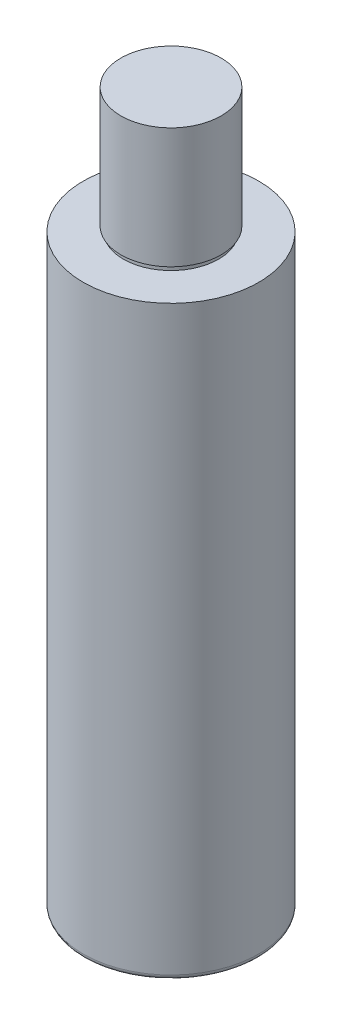
ISO-10303-21;
HEADER;
FILE_DESCRIPTION(('STEP AP214'),'2;1');
FILE_NAME('part.step','',(''),(''),'','','');
FILE_SCHEMA(('AUTOMOTIVE_DESIGN { 1 0 10303 214 1 1 1 1 }'));
ENDSEC;
DATA;
#1=APPLICATION_CONTEXT('core data for automotive mechanical design processes');
#2=APPLICATION_PROTOCOL_DEFINITION('international standard','automotive_design',2000,#1);
#3=PRODUCT_CONTEXT('',#1,'mechanical');
#4=PRODUCT('Part','Part','',(#3));
#5=PRODUCT_RELATED_PRODUCT_CATEGORY('part','',(#4));
#6=PRODUCT_DEFINITION_FORMATION('','',#4);
#7=PRODUCT_DEFINITION_CONTEXT('part definition',#1,'design');
#8=PRODUCT_DEFINITION('design','',#6,#7);
#9=PRODUCT_DEFINITION_SHAPE('','',#8);
#10=(LENGTH_UNIT() NAMED_UNIT(*) SI_UNIT(.MILLI.,.METRE.));
#11=(NAMED_UNIT(*) PLANE_ANGLE_UNIT() SI_UNIT($,.RADIAN.));
#12=(NAMED_UNIT(*) SI_UNIT($,.STERADIAN.) SOLID_ANGLE_UNIT());
#13=UNCERTAINTY_MEASURE_WITH_UNIT(LENGTH_MEASURE(1.E-05),#10,'distance_accuracy_value','');
#14=(GEOMETRIC_REPRESENTATION_CONTEXT(3) GLOBAL_UNCERTAINTY_ASSIGNED_CONTEXT((#13)) GLOBAL_UNIT_ASSIGNED_CONTEXT((#10,
#11,#12)) REPRESENTATION_CONTEXT('',''));
#15=CARTESIAN_POINT('',(0.,0.,0.));
#16=DIRECTION('',(0.,0.,1.));
#17=DIRECTION('',(1.,0.,0.));
#18=AXIS2_PLACEMENT_3D('',#15,#16,#17);
#19=CARTESIAN_POINT('',(0.,142.,0.));
#20=DIRECTION('',(0.,-1.,0.));
#21=DIRECTION('',(0.,0.,-1.));
#22=AXIS2_PLACEMENT_3D('',#19,#20,#21);
#23=CYLINDRICAL_SURFACE('',#22,17.5);
#24=CARTESIAN_POINT('',(0.,1.,0.));
#25=DIRECTION('',(0.,1.,0.));
#26=DIRECTION('',(0.,0.,1.));
#27=AXIS2_PLACEMENT_3D('',#24,#25,#26);
#28=CIRCLE('',#27,17.5);
#29=CARTESIAN_POINT('',(0.,1.,17.5));
#30=VERTEX_POINT('',#29);
#31=EDGE_CURVE('E42',#30,#30,#28,.T.);
#32=ORIENTED_EDGE('',*,*,#31,.T.);
#33=EDGE_LOOP('',(#32));
#34=FACE_BOUND('',#33,.T.);
#35=CARTESIAN_POINT('',(0.,117.,0.));
#36=DIRECTION('',(0.,1.,0.));
#37=DIRECTION('',(0.,0.,1.));
#38=AXIS2_PLACEMENT_3D('',#35,#36,#37);
#39=CIRCLE('',#38,17.5);
#40=CARTESIAN_POINT('',(0.,117.,17.5));
#41=VERTEX_POINT('',#40);
#42=EDGE_CURVE('E46',#41,#41,#39,.T.);
#43=ORIENTED_EDGE('',*,*,#42,.F.);
#44=EDGE_LOOP('',(#43));
#45=FACE_BOUND('',#44,.T.);
#46=ADVANCED_FACE('F35',(#34,#45),#23,.T.);
#47=CARTESIAN_POINT('',(0.,0.,0.));
#48=DIRECTION('',(0.,1.,0.));
#49=DIRECTION('',(0.,0.,1.));
#50=AXIS2_PLACEMENT_3D('',#47,#48,#49);
#51=PLANE('',#50);
#52=CARTESIAN_POINT('',(0.,0.,0.));
#53=DIRECTION('',(0.,1.,0.));
#54=DIRECTION('',(0.,0.,1.));
#55=AXIS2_PLACEMENT_3D('',#52,#53,#54);
#56=CIRCLE('',#55,16.5);
#57=CARTESIAN_POINT('',(0.,0.,16.5));
#58=VERTEX_POINT('',#57);
#59=EDGE_CURVE('E11',#58,#58,#56,.F.);
#60=ORIENTED_EDGE('',*,*,#59,.T.);
#61=EDGE_LOOP('',(#60));
#62=FACE_BOUND('',#61,.T.);
#63=ADVANCED_FACE('F76',(#62),#51,.F.);
#64=CARTESIAN_POINT('',(0.,117.,0.));
#65=DIRECTION('',(0.,1.,0.));
#66=DIRECTION('',(0.,0.,1.));
#67=AXIS2_PLACEMENT_3D('',#64,#65,#66);
#68=PLANE('',#67);
#69=ORIENTED_EDGE('',*,*,#42,.T.);
#70=EDGE_LOOP('',(#69));
#71=FACE_BOUND('',#70,.T.);
#72=CARTESIAN_POINT('',(0.,117.,0.));
#73=DIRECTION('',(0.,1.,0.));
#74=DIRECTION('',(0.,0.,1.));
#75=AXIS2_PLACEMENT_3D('',#72,#73,#74);
#76=CIRCLE('',#75,9.5);
#77=CARTESIAN_POINT('',(0.,117.,9.5));
#78=VERTEX_POINT('',#77);
#79=EDGE_CURVE('E59',#78,#78,#76,.T.);
#80=ORIENTED_EDGE('',*,*,#79,.F.);
#81=EDGE_LOOP('',(#80));
#82=FACE_BOUND('',#81,.T.);
#83=ADVANCED_FACE('F74',(#71,#82),#68,.T.);
#84=CARTESIAN_POINT('',(0.,118.,0.));
#85=DIRECTION('',(0.,1.,0.));
#86=DIRECTION('',(0.,0.,1.));
#87=AXIS2_PLACEMENT_3D('',#84,#85,#86);
#88=PLANE('',#87);
#89=CARTESIAN_POINT('',(0.,118.,0.));
#90=DIRECTION('',(0.,1.,0.));
#91=DIRECTION('',(0.,0.,1.));
#92=AXIS2_PLACEMENT_3D('',#89,#90,#91);
#93=CIRCLE('',#92,10.);
#94=CARTESIAN_POINT('',(0.,118.,10.));
#95=VERTEX_POINT('',#94);
#96=EDGE_CURVE('E53',#95,#95,#93,.F.);
#97=ORIENTED_EDGE('',*,*,#96,.T.);
#98=EDGE_LOOP('',(#97));
#99=FACE_BOUND('',#98,.T.);
#100=CARTESIAN_POINT('',(0.,118.,0.));
#101=DIRECTION('',(0.,1.,0.));
#102=DIRECTION('',(0.,0.,1.));
#103=AXIS2_PLACEMENT_3D('',#100,#101,#102);
#104=CIRCLE('',#103,9.5);
#105=CARTESIAN_POINT('',(0.,118.,9.5));
#106=VERTEX_POINT('',#105);
#107=EDGE_CURVE('E55',#106,#106,#104,.T.);
#108=ORIENTED_EDGE('',*,*,#107,.T.);
#109=EDGE_LOOP('',(#108));
#110=FACE_BOUND('',#109,.T.);
#111=ADVANCED_FACE('F65',(#99,#110),#88,.F.);
#112=CARTESIAN_POINT('',(0.,118.,0.));
#113=DIRECTION('',(0.,-1.,0.));
#114=DIRECTION('',(0.,0.,-1.));
#115=AXIS2_PLACEMENT_3D('',#112,#113,#114);
#116=CYLINDRICAL_SURFACE('',#115,9.5);
#117=ORIENTED_EDGE('',*,*,#107,.F.);
#118=EDGE_LOOP('',(#117));
#119=FACE_BOUND('',#118,.T.);
#120=ORIENTED_EDGE('',*,*,#79,.T.);
#121=EDGE_LOOP('',(#120));
#122=FACE_BOUND('',#121,.T.);
#123=ADVANCED_FACE('F67',(#119,#122),#116,.T.);
#124=CARTESIAN_POINT('',(0.,142.,0.));
#125=DIRECTION('',(0.,1.,0.));
#126=DIRECTION('',(0.,0.,1.));
#127=AXIS2_PLACEMENT_3D('',#124,#125,#126);
#128=PLANE('',#127);
#129=CARTESIAN_POINT('',(0.,142.,0.));
#130=DIRECTION('',(0.,1.,0.));
#131=DIRECTION('',(0.,0.,1.));
#132=AXIS2_PLACEMENT_3D('',#129,#130,#131);
#133=CIRCLE('',#132,10.);
#134=CARTESIAN_POINT('',(0.,142.,10.));
#135=VERTEX_POINT('',#134);
#136=EDGE_CURVE('E50',#135,#135,#133,.T.);
#137=ORIENTED_EDGE('',*,*,#136,.T.);
#138=EDGE_LOOP('',(#137));
#139=FACE_BOUND('',#138,.T.);
#140=ADVANCED_FACE('F70',(#139),#128,.T.);
#141=CARTESIAN_POINT('',(0.,117.,0.));
#142=DIRECTION('',(0.,1.,0.));
#143=DIRECTION('',(0.,0.,1.));
#144=AXIS2_PLACEMENT_3D('',#141,#142,#143);
#145=CYLINDRICAL_SURFACE('',#144,10.);
#146=ORIENTED_EDGE('',*,*,#96,.F.);
#147=EDGE_LOOP('',(#146));
#148=FACE_BOUND('',#147,.T.);
#149=ORIENTED_EDGE('',*,*,#136,.F.);
#150=EDGE_LOOP('',(#149));
#151=FACE_BOUND('',#150,.T.);
#152=ADVANCED_FACE('F93',(#148,#151),#145,.T.);
#153=CARTESIAN_POINT('',(0.,1.,0.));
#154=DIRECTION('',(0.,1.,0.));
#155=DIRECTION('',(0.,0.,1.));
#156=AXIS2_PLACEMENT_3D('',#153,#154,#155);
#157=TOROIDAL_SURFACE('',#156,16.5,1.);
#158=ORIENTED_EDGE('',*,*,#59,.F.);
#159=EDGE_LOOP('',(#158));
#160=FACE_BOUND('',#159,.T.);
#161=ORIENTED_EDGE('',*,*,#31,.F.);
#162=EDGE_LOOP('',(#161));
#163=FACE_BOUND('',#162,.T.);
#164=ADVANCED_FACE('F37',(#160,#163),#157,.T.);
#165=CLOSED_SHELL('',(#46,#63,#83,#111,#123,#140,#152,#164));
#166=MANIFOLD_SOLID_BREP('B2',#165);
#167=ADVANCED_BREP_SHAPE_REPRESENTATION('',(#18,#166),#14);
#168=SHAPE_DEFINITION_REPRESENTATION(#9,#167);
ENDSEC;
END-ISO-10303-21;
